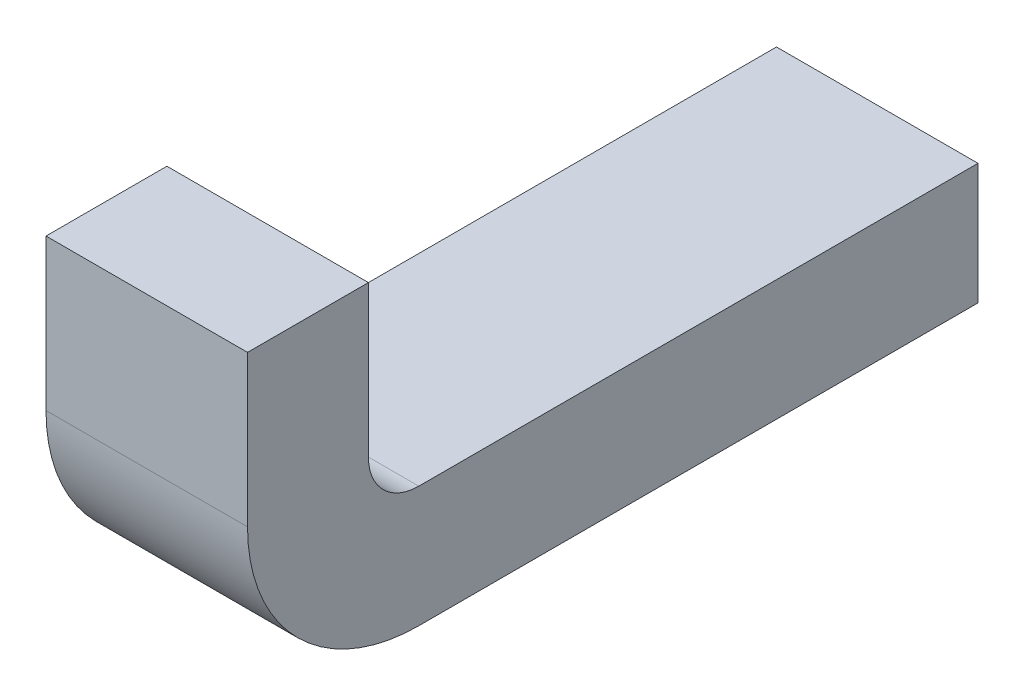
ISO-10303-21;
HEADER;
FILE_DESCRIPTION(('STEP AP214'),'2;1');
FILE_NAME('part.step','',(''),(''),'','','');
FILE_SCHEMA(('AUTOMOTIVE_DESIGN { 1 0 10303 214 1 1 1 1 }'));
ENDSEC;
DATA;
#1=APPLICATION_CONTEXT('core data for automotive mechanical design processes');
#2=APPLICATION_PROTOCOL_DEFINITION('international standard','automotive_design',2000,#1);
#3=PRODUCT_CONTEXT('',#1,'mechanical');
#4=PRODUCT('Part','Part','',(#3));
#5=PRODUCT_RELATED_PRODUCT_CATEGORY('part','',(#4));
#6=PRODUCT_DEFINITION_FORMATION('','',#4);
#7=PRODUCT_DEFINITION_CONTEXT('part definition',#1,'design');
#8=PRODUCT_DEFINITION('design','',#6,#7);
#9=PRODUCT_DEFINITION_SHAPE('','',#8);
#10=(LENGTH_UNIT() NAMED_UNIT(*) SI_UNIT(.MILLI.,.METRE.));
#11=(NAMED_UNIT(*) PLANE_ANGLE_UNIT() SI_UNIT($,.RADIAN.));
#12=(NAMED_UNIT(*) SI_UNIT($,.STERADIAN.) SOLID_ANGLE_UNIT());
#13=UNCERTAINTY_MEASURE_WITH_UNIT(LENGTH_MEASURE(1.E-05),#10,'distance_accuracy_value','');
#14=(GEOMETRIC_REPRESENTATION_CONTEXT(3) GLOBAL_UNCERTAINTY_ASSIGNED_CONTEXT((#13)) GLOBAL_UNIT_ASSIGNED_CONTEXT((#10,
#11,#12)) REPRESENTATION_CONTEXT('',''));
#15=CARTESIAN_POINT('',(0.,0.,0.));
#16=DIRECTION('',(0.,0.,1.));
#17=DIRECTION('',(1.,0.,0.));
#18=AXIS2_PLACEMENT_3D('',#15,#16,#17);
#19=CARTESIAN_POINT('',(2.95,0.32,-3.130000000002));
#20=DIRECTION('',(0.,0.,1.));
#21=DIRECTION('',(1.,0.,0.));
#22=AXIS2_PLACEMENT_3D('',#19,#20,#21);
#23=PLANE('',#22);
#24=DIRECTION('',(0.,1.,0.));
#25=VECTOR('',#24,1.);
#26=CARTESIAN_POINT('',(2.975,0.17,-3.130000000002));
#27=LINE('',#26,#25);
#28=CARTESIAN_POINT('',(2.975,0.17,-3.130000000002));
#29=VERTEX_POINT('',#28);
#30=CARTESIAN_POINT('',(2.975,0.319999999999995,-3.130000000002));
#31=VERTEX_POINT('',#30);
#32=EDGE_CURVE('E123',#29,#31,#27,.T.);
#33=ORIENTED_EDGE('',*,*,#32,.F.);
#34=DIRECTION('',(1.,0.,0.));
#35=VECTOR('',#34,1.);
#36=CARTESIAN_POINT('',(2.95,0.17,-3.130000000002));
#37=LINE('',#36,#35);
#38=CARTESIAN_POINT('',(3.175,0.17,-3.130000000002));
#39=VERTEX_POINT('',#38);
#40=EDGE_CURVE('E64',#39,#29,#37,.F.);
#41=ORIENTED_EDGE('',*,*,#40,.F.);
#42=DIRECTION('',(0.,1.,0.));
#43=VECTOR('',#42,1.);
#44=CARTESIAN_POINT('',(3.175,0.32,-3.130000000002));
#45=LINE('',#44,#43);
#46=CARTESIAN_POINT('',(3.175,0.319999999999995,-3.130000000002));
#47=VERTEX_POINT('',#46);
#48=EDGE_CURVE('E70',#39,#47,#45,.T.);
#49=ORIENTED_EDGE('',*,*,#48,.T.);
#50=DIRECTION('',(1.,0.,0.));
#51=VECTOR('',#50,1.);
#52=CARTESIAN_POINT('',(2.95,0.319999999999985,-3.130000000002));
#53=LINE('',#52,#51);
#54=EDGE_CURVE('E160',#31,#47,#53,.T.);
#55=ORIENTED_EDGE('',*,*,#54,.F.);
#56=EDGE_LOOP('',(#33,#41,#49,#55));
#57=FACE_BOUND('',#56,.T.);
#58=ADVANCED_FACE('F16',(#57),#23,.T.);
#59=CARTESIAN_POINT('',(2.95,0.32,-3.250000000002));
#60=DIRECTION('',(0.,1.,1.246832498358E-13));
#61=DIRECTION('',(0.,-1.246832498358E-13,1.));
#62=AXIS2_PLACEMENT_3D('',#59,#60,#61);
#63=PLANE('',#62);
#64=DIRECTION('',(0.,0.,1.));
#65=VECTOR('',#64,1.);
#66=CARTESIAN_POINT('',(2.975,0.32,-3.300000000002));
#67=LINE('',#66,#65);
#68=CARTESIAN_POINT('',(2.975,0.32,-3.250000000002));
#69=VERTEX_POINT('',#68);
#70=EDGE_CURVE('E101',#31,#69,#67,.F.);
#71=ORIENTED_EDGE('',*,*,#70,.F.);
#72=ORIENTED_EDGE('',*,*,#54,.T.);
#73=DIRECTION('',(0.,0.,1.));
#74=VECTOR('',#73,1.);
#75=CARTESIAN_POINT('',(3.175,0.32,3.855));
#76=LINE('',#75,#74);
#77=CARTESIAN_POINT('',(3.175,0.32,-3.250000000002));
#78=VERTEX_POINT('',#77);
#79=EDGE_CURVE('E148',#47,#78,#76,.F.);
#80=ORIENTED_EDGE('',*,*,#79,.T.);
#81=DIRECTION('',(-1.,0.,0.));
#82=VECTOR('',#81,1.);
#83=CARTESIAN_POINT('',(2.95,0.32,-3.250000000002));
#84=LINE('',#83,#82);
#85=EDGE_CURVE('E155',#69,#78,#84,.F.);
#86=ORIENTED_EDGE('',*,*,#85,.F.);
#87=EDGE_LOOP('',(#71,#72,#80,#86));
#88=FACE_BOUND('',#87,.T.);
#89=ADVANCED_FACE('F179',(#88),#63,.T.);
#90=CARTESIAN_POINT('',(2.95,0.,-3.300000000002));
#91=DIRECTION('',(0.,-1.,0.));
#92=DIRECTION('',(0.,0.,-1.));
#93=AXIS2_PLACEMENT_3D('',#90,#91,#92);
#94=PLANE('',#93);
#95=DIRECTION('',(0.,0.,1.));
#96=VECTOR('',#95,1.);
#97=CARTESIAN_POINT('',(2.975,0.,-3.300000000002));
#98=LINE('',#97,#96);
#99=CARTESIAN_POINT('',(2.975,0.,-3.854999999999));
#100=VERTEX_POINT('',#99);
#101=CARTESIAN_POINT('',(2.975,0.,-3.300000000002));
#102=VERTEX_POINT('',#101);
#103=EDGE_CURVE('E112',#100,#102,#98,.T.);
#104=ORIENTED_EDGE('',*,*,#103,.F.);
#105=DIRECTION('',(-1.,0.,0.));
#106=VECTOR('',#105,1.);
#107=CARTESIAN_POINT('',(2.95,0.,-3.854999999999));
#108=LINE('',#107,#106);
#109=CARTESIAN_POINT('',(3.175,0.,-3.854999999999));
#110=VERTEX_POINT('',#109);
#111=EDGE_CURVE('E125',#110,#100,#108,.T.);
#112=ORIENTED_EDGE('',*,*,#111,.F.);
#113=DIRECTION('',(0.,0.,1.));
#114=VECTOR('',#113,1.);
#115=CARTESIAN_POINT('',(3.175,0.,3.855));
#116=LINE('',#115,#114);
#117=CARTESIAN_POINT('',(3.175,0.,-3.300000000002));
#118=VERTEX_POINT('',#117);
#119=EDGE_CURVE('E57',#110,#118,#116,.T.);
#120=ORIENTED_EDGE('',*,*,#119,.T.);
#121=DIRECTION('',(1.,0.,0.));
#122=VECTOR('',#121,1.);
#123=CARTESIAN_POINT('',(2.95,0.,-3.300000000002));
#124=LINE('',#123,#122);
#125=EDGE_CURVE('E159',#102,#118,#124,.T.);
#126=ORIENTED_EDGE('',*,*,#125,.F.);
#127=EDGE_LOOP('',(#104,#112,#120,#126));
#128=FACE_BOUND('',#127,.T.);
#129=ADVANCED_FACE('F189',(#128),#94,.T.);
#130=CARTESIAN_POINT('',(2.95,0.17,-3.300000000002));
#131=DIRECTION('',(1.,0.,0.));
#132=DIRECTION('',(0.,0.,-1.));
#133=AXIS2_PLACEMENT_3D('',#130,#131,#132);
#134=CYLINDRICAL_SURFACE('',#133,0.17);
#135=CARTESIAN_POINT('',(2.975,0.17,-3.300000000002));
#136=DIRECTION('',(1.,0.,0.));
#137=DIRECTION('',(0.,0.,-1.));
#138=AXIS2_PLACEMENT_3D('',#135,#136,#137);
#139=CIRCLE('',#138,0.17);
#140=EDGE_CURVE('E95',#102,#29,#139,.F.);
#141=ORIENTED_EDGE('',*,*,#140,.F.);
#142=ORIENTED_EDGE('',*,*,#125,.T.);
#143=CARTESIAN_POINT('',(3.175,0.17,-3.300000000002));
#144=DIRECTION('',(1.,0.,0.));
#145=DIRECTION('',(0.,0.,-1.));
#146=AXIS2_PLACEMENT_3D('',#143,#144,#145);
#147=CIRCLE('',#146,0.17);
#148=EDGE_CURVE('E19',#118,#39,#147,.F.);
#149=ORIENTED_EDGE('',*,*,#148,.T.);
#150=ORIENTED_EDGE('',*,*,#40,.T.);
#151=EDGE_LOOP('',(#141,#142,#149,#150));
#152=FACE_BOUND('',#151,.T.);
#153=ADVANCED_FACE('F192',(#152),#134,.T.);
#154=CARTESIAN_POINT('',(2.95,0.17,-3.250000000002));
#155=DIRECTION('',(0.,0.,-1.));
#156=DIRECTION('',(-1.,0.,0.));
#157=AXIS2_PLACEMENT_3D('',#154,#155,#156);
#158=PLANE('',#157);
#159=DIRECTION('',(0.,1.,0.));
#160=VECTOR('',#159,1.);
#161=CARTESIAN_POINT('',(2.975,0.17,-3.250000000002));
#162=LINE('',#161,#160);
#163=CARTESIAN_POINT('',(2.975,0.17,-3.250000000002));
#164=VERTEX_POINT('',#163);
#165=EDGE_CURVE('E91',#69,#164,#162,.F.);
#166=ORIENTED_EDGE('',*,*,#165,.F.);
#167=ORIENTED_EDGE('',*,*,#85,.T.);
#168=DIRECTION('',(0.,1.,0.));
#169=VECTOR('',#168,1.);
#170=CARTESIAN_POINT('',(3.175,0.32,-3.250000000002));
#171=LINE('',#170,#169);
#172=CARTESIAN_POINT('',(3.175,0.17,-3.250000000002));
#173=VERTEX_POINT('',#172);
#174=EDGE_CURVE('E85',#78,#173,#171,.F.);
#175=ORIENTED_EDGE('',*,*,#174,.T.);
#176=DIRECTION('',(1.,0.,0.));
#177=VECTOR('',#176,1.);
#178=CARTESIAN_POINT('',(2.95,0.17,-3.250000000002));
#179=LINE('',#178,#177);
#180=EDGE_CURVE('E89',#173,#164,#179,.F.);
#181=ORIENTED_EDGE('',*,*,#180,.T.);
#182=EDGE_LOOP('',(#166,#167,#175,#181));
#183=FACE_BOUND('',#182,.T.);
#184=ADVANCED_FACE('F90',(#183),#158,.T.);
#185=CARTESIAN_POINT('',(3.175,0.32,3.855));
#186=DIRECTION('',(-1.,0.,0.));
#187=DIRECTION('',(0.,0.,1.));
#188=AXIS2_PLACEMENT_3D('',#185,#186,#187);
#189=PLANE('',#188);
#190=ORIENTED_EDGE('',*,*,#79,.F.);
#191=ORIENTED_EDGE('',*,*,#48,.F.);
#192=ORIENTED_EDGE('',*,*,#148,.F.);
#193=ORIENTED_EDGE('',*,*,#119,.F.);
#194=DIRECTION('',(0.,1.,0.));
#195=VECTOR('',#194,1.);
#196=CARTESIAN_POINT('',(3.175,0.,-3.854999999999));
#197=LINE('',#196,#195);
#198=CARTESIAN_POINT('',(3.175,0.12,-3.854999999999));
#199=VERTEX_POINT('',#198);
#200=EDGE_CURVE('E138',#199,#110,#197,.F.);
#201=ORIENTED_EDGE('',*,*,#200,.F.);
#202=DIRECTION('',(0.,0.,1.));
#203=VECTOR('',#202,1.);
#204=CARTESIAN_POINT('',(3.175,0.12,-3.854999999999));
#205=LINE('',#204,#203);
#206=CARTESIAN_POINT('',(3.175,0.12,-3.300000000002));
#207=VERTEX_POINT('',#206);
#208=EDGE_CURVE('E108',#207,#199,#205,.F.);
#209=ORIENTED_EDGE('',*,*,#208,.F.);
#210=CARTESIAN_POINT('',(3.175,0.17,-3.300000000002));
#211=DIRECTION('',(1.,0.,0.));
#212=DIRECTION('',(0.,0.,-1.));
#213=AXIS2_PLACEMENT_3D('',#210,#211,#212);
#214=CIRCLE('',#213,0.05);
#215=EDGE_CURVE('E106',#207,#173,#214,.F.);
#216=ORIENTED_EDGE('',*,*,#215,.T.);
#217=ORIENTED_EDGE('',*,*,#174,.F.);
#218=EDGE_LOOP('',(#190,#191,#192,#193,#201,#209,#216,#217));
#219=FACE_BOUND('',#218,.T.);
#220=ADVANCED_FACE('F181',(#219),#189,.F.);
#221=CARTESIAN_POINT('',(2.95,0.,-3.854999999999));
#222=DIRECTION('',(0.,0.,-1.));
#223=DIRECTION('',(-1.,0.,0.));
#224=AXIS2_PLACEMENT_3D('',#221,#222,#223);
#225=PLANE('',#224);
#226=DIRECTION('',(0.,1.,0.));
#227=VECTOR('',#226,1.);
#228=CARTESIAN_POINT('',(2.975,0.17,-3.854999999999));
#229=LINE('',#228,#227);
#230=CARTESIAN_POINT('',(2.975,0.12,-3.854999999999));
#231=VERTEX_POINT('',#230);
#232=EDGE_CURVE('E102',#231,#100,#229,.F.);
#233=ORIENTED_EDGE('',*,*,#232,.F.);
#234=DIRECTION('',(1.,0.,0.));
#235=VECTOR('',#234,1.);
#236=CARTESIAN_POINT('',(2.95,0.12,-3.854999999999));
#237=LINE('',#236,#235);
#238=EDGE_CURVE('E129',#199,#231,#237,.F.);
#239=ORIENTED_EDGE('',*,*,#238,.F.);
#240=ORIENTED_EDGE('',*,*,#200,.T.);
#241=ORIENTED_EDGE('',*,*,#111,.T.);
#242=EDGE_LOOP('',(#233,#239,#240,#241));
#243=FACE_BOUND('',#242,.T.);
#244=ADVANCED_FACE('F188',(#243),#225,.T.);
#245=CARTESIAN_POINT('',(2.975,0.17,-3.300000000002));
#246=DIRECTION('',(-1.,0.,0.));
#247=DIRECTION('',(0.,0.,1.));
#248=AXIS2_PLACEMENT_3D('',#245,#246,#247);
#249=PLANE('',#248);
#250=ORIENTED_EDGE('',*,*,#103,.T.);
#251=ORIENTED_EDGE('',*,*,#140,.T.);
#252=ORIENTED_EDGE('',*,*,#32,.T.);
#253=ORIENTED_EDGE('',*,*,#70,.T.);
#254=ORIENTED_EDGE('',*,*,#165,.T.);
#255=CARTESIAN_POINT('',(2.975,0.17,-3.300000000002));
#256=DIRECTION('',(1.,0.,0.));
#257=DIRECTION('',(0.,0.,-1.));
#258=AXIS2_PLACEMENT_3D('',#255,#256,#257);
#259=CIRCLE('',#258,0.05);
#260=CARTESIAN_POINT('',(2.975,0.12,-3.300000000002));
#261=VERTEX_POINT('',#260);
#262=EDGE_CURVE('E34',#164,#261,#259,.T.);
#263=ORIENTED_EDGE('',*,*,#262,.T.);
#264=DIRECTION('',(0.,0.,1.));
#265=VECTOR('',#264,1.);
#266=CARTESIAN_POINT('',(2.975,0.12,-3.854999999999));
#267=LINE('',#266,#265);
#268=EDGE_CURVE('E25',#231,#261,#267,.T.);
#269=ORIENTED_EDGE('',*,*,#268,.F.);
#270=ORIENTED_EDGE('',*,*,#232,.T.);
#271=EDGE_LOOP('',(#250,#251,#252,#253,#254,#263,#269,#270));
#272=FACE_BOUND('',#271,.T.);
#273=ADVANCED_FACE('F98',(#272),#249,.T.);
#274=CARTESIAN_POINT('',(2.95,0.17,-3.300000000002));
#275=DIRECTION('',(1.,0.,0.));
#276=DIRECTION('',(0.,0.,-1.));
#277=AXIS2_PLACEMENT_3D('',#274,#275,#276);
#278=CYLINDRICAL_SURFACE('',#277,0.05);
#279=DIRECTION('',(1.,0.,0.));
#280=VECTOR('',#279,1.);
#281=CARTESIAN_POINT('',(2.95,0.12,-3.300000000002));
#282=LINE('',#281,#280);
#283=EDGE_CURVE('E11',#261,#207,#282,.T.);
#284=ORIENTED_EDGE('',*,*,#283,.F.);
#285=ORIENTED_EDGE('',*,*,#262,.F.);
#286=ORIENTED_EDGE('',*,*,#180,.F.);
#287=ORIENTED_EDGE('',*,*,#215,.F.);
#288=EDGE_LOOP('',(#284,#285,#286,#287));
#289=FACE_BOUND('',#288,.T.);
#290=ADVANCED_FACE('F104',(#289),#278,.F.);
#291=CARTESIAN_POINT('',(2.95,0.12,-3.854999999999));
#292=DIRECTION('',(0.,1.,0.));
#293=DIRECTION('',(0.,0.,1.));
#294=AXIS2_PLACEMENT_3D('',#291,#292,#293);
#295=PLANE('',#294);
#296=ORIENTED_EDGE('',*,*,#268,.T.);
#297=ORIENTED_EDGE('',*,*,#283,.T.);
#298=ORIENTED_EDGE('',*,*,#208,.T.);
#299=ORIENTED_EDGE('',*,*,#238,.T.);
#300=EDGE_LOOP('',(#296,#297,#298,#299));
#301=FACE_BOUND('',#300,.T.);
#302=ADVANCED_FACE('F184',(#301),#295,.T.);
#303=CLOSED_SHELL('',(#58,#89,#129,#153,#184,#220,#244,#273,#290,#302));
#304=MANIFOLD_SOLID_BREP('B1',#303);
#305=ADVANCED_BREP_SHAPE_REPRESENTATION('',(#18,#304),#14);
#306=SHAPE_DEFINITION_REPRESENTATION(#9,#305);
ENDSEC;
END-ISO-10303-21;
